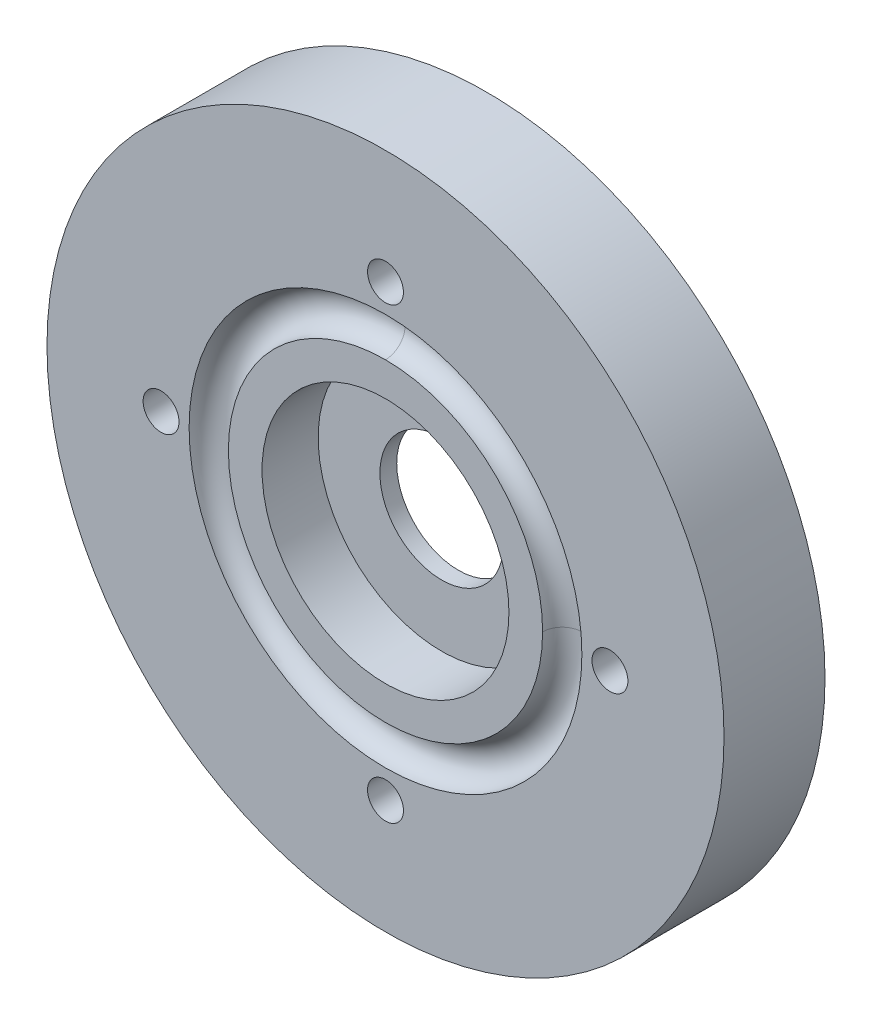
ISO-10303-21;
HEADER;
FILE_DESCRIPTION(('STEP AP214'),'2;1');
FILE_NAME('part.step','',(''),(''),'','','');
FILE_SCHEMA(('AUTOMOTIVE_DESIGN { 1 0 10303 214 1 1 1 1 }'));
ENDSEC;
DATA;
#1=APPLICATION_CONTEXT('core data for automotive mechanical design processes');
#2=APPLICATION_PROTOCOL_DEFINITION('international standard','automotive_design',2000,#1);
#3=PRODUCT_CONTEXT('',#1,'mechanical');
#4=PRODUCT('Part','Part','',(#3));
#5=PRODUCT_RELATED_PRODUCT_CATEGORY('part','',(#4));
#6=PRODUCT_DEFINITION_FORMATION('','',#4);
#7=PRODUCT_DEFINITION_CONTEXT('part definition',#1,'design');
#8=PRODUCT_DEFINITION('design','',#6,#7);
#9=PRODUCT_DEFINITION_SHAPE('','',#8);
#10=(LENGTH_UNIT() NAMED_UNIT(*) SI_UNIT(.MILLI.,.METRE.));
#11=(NAMED_UNIT(*) PLANE_ANGLE_UNIT() SI_UNIT($,.RADIAN.));
#12=(NAMED_UNIT(*) SI_UNIT($,.STERADIAN.) SOLID_ANGLE_UNIT());
#13=UNCERTAINTY_MEASURE_WITH_UNIT(LENGTH_MEASURE(1.E-05),#10,'distance_accuracy_value','');
#14=(GEOMETRIC_REPRESENTATION_CONTEXT(3) GLOBAL_UNCERTAINTY_ASSIGNED_CONTEXT((#13)) GLOBAL_UNIT_ASSIGNED_CONTEXT((#10,
#11,#12)) REPRESENTATION_CONTEXT('',''));
#15=CARTESIAN_POINT('',(0.,0.,0.));
#16=DIRECTION('',(0.,0.,1.));
#17=DIRECTION('',(1.,0.,0.));
#18=AXIS2_PLACEMENT_3D('',#15,#16,#17);
#19=CARTESIAN_POINT('',(0.,0.,4.5));
#20=DIRECTION('',(0.,0.,1.));
#21=DIRECTION('',(1.,0.,0.));
#22=AXIS2_PLACEMENT_3D('',#19,#20,#21);
#23=PLANE('',#22);
#24=CARTESIAN_POINT('',(0.,-20.,4.5));
#25=DIRECTION('',(0.,0.,1.));
#26=DIRECTION('',(1.,0.,0.));
#27=AXIS2_PLACEMENT_3D('',#24,#25,#26);
#28=CIRCLE('',#27,1.6);
#29=CARTESIAN_POINT('',(1.6,-20.,4.5));
#30=VERTEX_POINT('',#29);
#31=EDGE_CURVE('E84',#30,#30,#28,.T.);
#32=ORIENTED_EDGE('',*,*,#31,.F.);
#33=EDGE_LOOP('',(#32));
#34=FACE_BOUND('',#33,.T.);
#35=CARTESIAN_POINT('',(20.,0.,4.5));
#36=DIRECTION('',(0.,0.,1.));
#37=DIRECTION('',(1.,0.,0.));
#38=AXIS2_PLACEMENT_3D('',#35,#36,#37);
#39=CIRCLE('',#38,1.6);
#40=CARTESIAN_POINT('',(21.6,0.,4.5));
#41=VERTEX_POINT('',#40);
#42=EDGE_CURVE('E106',#41,#41,#39,.T.);
#43=ORIENTED_EDGE('',*,*,#42,.F.);
#44=EDGE_LOOP('',(#43));
#45=FACE_BOUND('',#44,.T.);
#46=CARTESIAN_POINT('',(0.,0.,4.5));
#47=DIRECTION('',(0.,0.,1.));
#48=DIRECTION('',(1.,0.,0.));
#49=AXIS2_PLACEMENT_3D('',#46,#47,#48);
#50=CIRCLE('',#49,30.165);
#51=CARTESIAN_POINT('',(30.165,0.,4.5));
#52=VERTEX_POINT('',#51);
#53=EDGE_CURVE('E100',#52,#52,#50,.T.);
#54=ORIENTED_EDGE('',*,*,#53,.T.);
#55=EDGE_LOOP('',(#54));
#56=FACE_BOUND('',#55,.T.);
#57=CARTESIAN_POINT('',(0.,20.,4.5));
#58=DIRECTION('',(0.,0.,1.));
#59=DIRECTION('',(1.,0.,0.));
#60=AXIS2_PLACEMENT_3D('',#57,#58,#59);
#61=CIRCLE('',#60,1.6);
#62=CARTESIAN_POINT('',(1.6,20.,4.5));
#63=VERTEX_POINT('',#62);
#64=EDGE_CURVE('E103',#63,#63,#61,.T.);
#65=ORIENTED_EDGE('',*,*,#64,.F.);
#66=EDGE_LOOP('',(#65));
#67=FACE_BOUND('',#66,.T.);
#68=CARTESIAN_POINT('',(-20.,0.,4.5));
#69=DIRECTION('',(0.,0.,1.));
#70=DIRECTION('',(1.,0.,0.));
#71=AXIS2_PLACEMENT_3D('',#68,#69,#70);
#72=CIRCLE('',#71,1.6);
#73=CARTESIAN_POINT('',(-18.4,0.,4.5));
#74=VERTEX_POINT('',#73);
#75=EDGE_CURVE('E109',#74,#74,#72,.T.);
#76=ORIENTED_EDGE('',*,*,#75,.F.);
#77=EDGE_LOOP('',(#76));
#78=FACE_BOUND('',#77,.T.);
#79=CARTESIAN_POINT('',(0.,0.,4.5));
#80=DIRECTION('',(0.,0.,1.));
#81=DIRECTION('',(1.,0.,0.));
#82=AXIS2_PLACEMENT_3D('',#79,#80,#81);
#83=CIRCLE('',#82,17.5);
#84=CARTESIAN_POINT('',(0.,17.5,4.5));
#85=VERTEX_POINT('',#84);
#86=CARTESIAN_POINT('',(17.5,0.,4.5));
#87=VERTEX_POINT('',#86);
#88=EDGE_CURVE('E11',#85,#87,#83,.T.);
#89=ORIENTED_EDGE('',*,*,#88,.F.);
#90=CARTESIAN_POINT('',(0.,0.,4.5));
#91=DIRECTION('',(0.,0.,1.));
#92=DIRECTION('',(1.,0.,0.));
#93=AXIS2_PLACEMENT_3D('',#90,#91,#92);
#94=CIRCLE('',#93,17.5);
#95=EDGE_CURVE('E43',#87,#85,#94,.T.);
#96=ORIENTED_EDGE('',*,*,#95,.F.);
#97=EDGE_LOOP('',(#89,#96));
#98=FACE_BOUND('',#97,.T.);
#99=ADVANCED_FACE('F35',(#34,#45,#56,#67,#78,#98),#23,.T.);
#100=CARTESIAN_POINT('',(0.,0.,4.5));
#101=DIRECTION('',(0.,0.,1.));
#102=DIRECTION('',(1.,0.,0.));
#103=AXIS2_PLACEMENT_3D('',#100,#101,#102);
#104=CIRCLE('',#103,11.);
#105=CARTESIAN_POINT('',(11.,0.,4.5));
#106=VERTEX_POINT('',#105);
#107=EDGE_CURVE('E71',#106,#106,#104,.T.);
#108=ORIENTED_EDGE('',*,*,#107,.F.);
#109=EDGE_LOOP('',(#108));
#110=FACE_BOUND('',#109,.T.);
#111=CARTESIAN_POINT('',(0.,0.,4.5));
#112=DIRECTION('',(0.,0.,-1.));
#113=DIRECTION('',(-1.,0.,0.));
#114=AXIS2_PLACEMENT_3D('',#111,#112,#113);
#115=CIRCLE('',#114,14.);
#116=CARTESIAN_POINT('',(14.,0.,4.5));
#117=VERTEX_POINT('',#116);
#118=CARTESIAN_POINT('',(0.,14.,4.5));
#119=VERTEX_POINT('',#118);
#120=EDGE_CURVE('E64',#117,#119,#115,.T.);
#121=ORIENTED_EDGE('',*,*,#120,.F.);
#122=CARTESIAN_POINT('',(0.,0.,4.5));
#123=DIRECTION('',(0.,0.,-1.));
#124=DIRECTION('',(-1.,0.,0.));
#125=AXIS2_PLACEMENT_3D('',#122,#123,#124);
#126=CIRCLE('',#125,14.);
#127=EDGE_CURVE('E60',#119,#117,#126,.T.);
#128=ORIENTED_EDGE('',*,*,#127,.F.);
#129=EDGE_LOOP('',(#121,#128));
#130=FACE_BOUND('',#129,.T.);
#131=ADVANCED_FACE('F73',(#110,#130),#23,.T.);
#132=CARTESIAN_POINT('',(0.,0.,-4.5));
#133=DIRECTION('',(0.,0.,1.));
#134=DIRECTION('',(1.,0.,0.));
#135=AXIS2_PLACEMENT_3D('',#132,#133,#134);
#136=CYLINDRICAL_SURFACE('',#135,5.5);
#137=CARTESIAN_POINT('',(0.,0.,-2.));
#138=DIRECTION('',(0.,0.,-1.));
#139=DIRECTION('',(-1.,0.,0.));
#140=AXIS2_PLACEMENT_3D('',#137,#138,#139);
#141=CIRCLE('',#140,5.5);
#142=CARTESIAN_POINT('',(-5.5,0.,-2.));
#143=VERTEX_POINT('',#142);
#144=EDGE_CURVE('E81',#143,#143,#141,.F.);
#145=ORIENTED_EDGE('',*,*,#144,.F.);
#146=EDGE_LOOP('',(#145));
#147=FACE_BOUND('',#146,.T.);
#148=CARTESIAN_POINT('',(0.,0.,-0.5));
#149=DIRECTION('',(0.,0.,1.));
#150=DIRECTION('',(1.,0.,0.));
#151=AXIS2_PLACEMENT_3D('',#148,#149,#150);
#152=CIRCLE('',#151,5.5);
#153=CARTESIAN_POINT('',(5.5,0.,-0.5));
#154=VERTEX_POINT('',#153);
#155=EDGE_CURVE('E76',#154,#154,#152,.F.);
#156=ORIENTED_EDGE('',*,*,#155,.F.);
#157=EDGE_LOOP('',(#156));
#158=FACE_BOUND('',#157,.T.);
#159=ADVANCED_FACE('F129',(#147,#158),#136,.F.);
#160=CARTESIAN_POINT('',(0.,0.,-4.5));
#161=DIRECTION('',(0.,0.,1.));
#162=DIRECTION('',(1.,0.,0.));
#163=AXIS2_PLACEMENT_3D('',#160,#161,#162);
#164=CYLINDRICAL_SURFACE('',#163,30.165);
#165=CARTESIAN_POINT('',(0.,0.,-4.5));
#166=DIRECTION('',(0.,0.,1.));
#167=DIRECTION('',(1.,0.,0.));
#168=AXIS2_PLACEMENT_3D('',#165,#166,#167);
#169=CIRCLE('',#168,30.165);
#170=CARTESIAN_POINT('',(30.165,0.,-4.5));
#171=VERTEX_POINT('',#170);
#172=EDGE_CURVE('E65',#171,#171,#169,.T.);
#173=ORIENTED_EDGE('',*,*,#172,.T.);
#174=EDGE_LOOP('',(#173));
#175=FACE_BOUND('',#174,.T.);
#176=ORIENTED_EDGE('',*,*,#53,.F.);
#177=EDGE_LOOP('',(#176));
#178=FACE_BOUND('',#177,.T.);
#179=ADVANCED_FACE('F37',(#175,#178),#164,.T.);
#180=CARTESIAN_POINT('',(0.,0.,-4.5));
#181=DIRECTION('',(0.,0.,1.));
#182=DIRECTION('',(1.,0.,0.));
#183=AXIS2_PLACEMENT_3D('',#180,#181,#182);
#184=PLANE('',#183);
#185=CARTESIAN_POINT('',(0.,0.,-4.5));
#186=DIRECTION('',(0.,0.,-1.));
#187=DIRECTION('',(-1.,0.,0.));
#188=AXIS2_PLACEMENT_3D('',#185,#186,#187);
#189=CIRCLE('',#188,9.5);
#190=CARTESIAN_POINT('',(-9.5,0.,-4.5));
#191=VERTEX_POINT('',#190);
#192=EDGE_CURVE('E79',#191,#191,#189,.T.);
#193=ORIENTED_EDGE('',*,*,#192,.F.);
#194=EDGE_LOOP('',(#193));
#195=FACE_BOUND('',#194,.T.);
#196=CARTESIAN_POINT('',(0.,-20.,-4.5));
#197=DIRECTION('',(0.,0.,1.));
#198=DIRECTION('',(1.,0.,0.));
#199=AXIS2_PLACEMENT_3D('',#196,#197,#198);
#200=CIRCLE('',#199,1.6);
#201=CARTESIAN_POINT('',(1.6,-20.,-4.5));
#202=VERTEX_POINT('',#201);
#203=EDGE_CURVE('E97',#202,#202,#200,.T.);
#204=ORIENTED_EDGE('',*,*,#203,.T.);
#205=EDGE_LOOP('',(#204));
#206=FACE_BOUND('',#205,.T.);
#207=CARTESIAN_POINT('',(-20.,0.,-4.5));
#208=DIRECTION('',(0.,0.,1.));
#209=DIRECTION('',(1.,0.,0.));
#210=AXIS2_PLACEMENT_3D('',#207,#208,#209);
#211=CIRCLE('',#210,1.6);
#212=CARTESIAN_POINT('',(-18.4,0.,-4.5));
#213=VERTEX_POINT('',#212);
#214=EDGE_CURVE('E94',#213,#213,#211,.T.);
#215=ORIENTED_EDGE('',*,*,#214,.T.);
#216=EDGE_LOOP('',(#215));
#217=FACE_BOUND('',#216,.T.);
#218=CARTESIAN_POINT('',(20.,0.,-4.5));
#219=DIRECTION('',(0.,0.,1.));
#220=DIRECTION('',(1.,0.,0.));
#221=AXIS2_PLACEMENT_3D('',#218,#219,#220);
#222=CIRCLE('',#221,1.6);
#223=CARTESIAN_POINT('',(21.6,0.,-4.5));
#224=VERTEX_POINT('',#223);
#225=EDGE_CURVE('E91',#224,#224,#222,.T.);
#226=ORIENTED_EDGE('',*,*,#225,.T.);
#227=EDGE_LOOP('',(#226));
#228=FACE_BOUND('',#227,.T.);
#229=CARTESIAN_POINT('',(0.,20.,-4.5));
#230=DIRECTION('',(0.,0.,1.));
#231=DIRECTION('',(1.,0.,0.));
#232=AXIS2_PLACEMENT_3D('',#229,#230,#231);
#233=CIRCLE('',#232,1.6);
#234=CARTESIAN_POINT('',(1.6,20.,-4.5));
#235=VERTEX_POINT('',#234);
#236=EDGE_CURVE('E88',#235,#235,#233,.T.);
#237=ORIENTED_EDGE('',*,*,#236,.T.);
#238=EDGE_LOOP('',(#237));
#239=FACE_BOUND('',#238,.T.);
#240=ORIENTED_EDGE('',*,*,#172,.F.);
#241=EDGE_LOOP('',(#240));
#242=FACE_BOUND('',#241,.T.);
#243=ADVANCED_FACE('F153',(#195,#206,#217,#228,#239,#242),#184,.F.);
#244=CARTESIAN_POINT('',(0.,20.,-4.5));
#245=DIRECTION('',(0.,0.,1.));
#246=DIRECTION('',(1.,0.,0.));
#247=AXIS2_PLACEMENT_3D('',#244,#245,#246);
#248=CYLINDRICAL_SURFACE('',#247,1.6);
#249=ORIENTED_EDGE('',*,*,#236,.F.);
#250=EDGE_LOOP('',(#249));
#251=FACE_BOUND('',#250,.T.);
#252=ORIENTED_EDGE('',*,*,#64,.T.);
#253=EDGE_LOOP('',(#252));
#254=FACE_BOUND('',#253,.T.);
#255=ADVANCED_FACE('F149',(#251,#254),#248,.F.);
#256=CARTESIAN_POINT('',(20.,0.,-4.5));
#257=DIRECTION('',(0.,0.,1.));
#258=DIRECTION('',(1.,0.,0.));
#259=AXIS2_PLACEMENT_3D('',#256,#257,#258);
#260=CYLINDRICAL_SURFACE('',#259,1.6);
#261=ORIENTED_EDGE('',*,*,#225,.F.);
#262=EDGE_LOOP('',(#261));
#263=FACE_BOUND('',#262,.T.);
#264=ORIENTED_EDGE('',*,*,#42,.T.);
#265=EDGE_LOOP('',(#264));
#266=FACE_BOUND('',#265,.T.);
#267=ADVANCED_FACE('F145',(#263,#266),#260,.F.);
#268=CARTESIAN_POINT('',(-20.,0.,-4.5));
#269=DIRECTION('',(0.,0.,1.));
#270=DIRECTION('',(1.,0.,0.));
#271=AXIS2_PLACEMENT_3D('',#268,#269,#270);
#272=CYLINDRICAL_SURFACE('',#271,1.6);
#273=ORIENTED_EDGE('',*,*,#214,.F.);
#274=EDGE_LOOP('',(#273));
#275=FACE_BOUND('',#274,.T.);
#276=ORIENTED_EDGE('',*,*,#75,.T.);
#277=EDGE_LOOP('',(#276));
#278=FACE_BOUND('',#277,.T.);
#279=ADVANCED_FACE('F141',(#275,#278),#272,.F.);
#280=CARTESIAN_POINT('',(0.,-20.,-4.5));
#281=DIRECTION('',(0.,0.,1.));
#282=DIRECTION('',(1.,0.,0.));
#283=AXIS2_PLACEMENT_3D('',#280,#281,#282);
#284=CYLINDRICAL_SURFACE('',#283,1.6);
#285=ORIENTED_EDGE('',*,*,#203,.F.);
#286=EDGE_LOOP('',(#285));
#287=FACE_BOUND('',#286,.T.);
#288=ORIENTED_EDGE('',*,*,#31,.T.);
#289=EDGE_LOOP('',(#288));
#290=FACE_BOUND('',#289,.T.);
#291=ADVANCED_FACE('F137',(#287,#290),#284,.F.);
#292=CARTESIAN_POINT('',(0.,0.,-2.));
#293=DIRECTION('',(0.,0.,-1.));
#294=DIRECTION('',(-1.,0.,0.));
#295=AXIS2_PLACEMENT_3D('',#292,#293,#294);
#296=PLANE('',#295);
#297=CARTESIAN_POINT('',(0.,0.,-2.));
#298=DIRECTION('',(0.,0.,-1.));
#299=DIRECTION('',(-1.,0.,0.));
#300=AXIS2_PLACEMENT_3D('',#297,#298,#299);
#301=CIRCLE('',#300,9.5);
#302=CARTESIAN_POINT('',(-9.5,0.,-2.));
#303=VERTEX_POINT('',#302);
#304=EDGE_CURVE('E85',#303,#303,#301,.T.);
#305=ORIENTED_EDGE('',*,*,#304,.T.);
#306=EDGE_LOOP('',(#305));
#307=FACE_BOUND('',#306,.T.);
#308=ORIENTED_EDGE('',*,*,#144,.T.);
#309=EDGE_LOOP('',(#308));
#310=FACE_BOUND('',#309,.T.);
#311=ADVANCED_FACE('F140',(#307,#310),#296,.T.);
#312=CARTESIAN_POINT('',(0.,0.,-2.));
#313=DIRECTION('',(0.,0.,-1.));
#314=DIRECTION('',(-1.,0.,0.));
#315=AXIS2_PLACEMENT_3D('',#312,#313,#314);
#316=CYLINDRICAL_SURFACE('',#315,9.5);
#317=ORIENTED_EDGE('',*,*,#304,.F.);
#318=EDGE_LOOP('',(#317));
#319=FACE_BOUND('',#318,.T.);
#320=ORIENTED_EDGE('',*,*,#192,.T.);
#321=EDGE_LOOP('',(#320));
#322=FACE_BOUND('',#321,.T.);
#323=ADVANCED_FACE('F135',(#319,#322),#316,.F.);
#324=CARTESIAN_POINT('',(0.,0.,-0.5));
#325=DIRECTION('',(0.,0.,1.));
#326=DIRECTION('',(1.,0.,0.));
#327=AXIS2_PLACEMENT_3D('',#324,#325,#326);
#328=PLANE('',#327);
#329=CARTESIAN_POINT('',(0.,0.,-0.5));
#330=DIRECTION('',(0.,0.,1.));
#331=DIRECTION('',(1.,0.,0.));
#332=AXIS2_PLACEMENT_3D('',#329,#330,#331);
#333=CIRCLE('',#332,11.);
#334=CARTESIAN_POINT('',(11.,0.,-0.5));
#335=VERTEX_POINT('',#334);
#336=EDGE_CURVE('E80',#335,#335,#333,.T.);
#337=ORIENTED_EDGE('',*,*,#336,.T.);
#338=EDGE_LOOP('',(#337));
#339=FACE_BOUND('',#338,.T.);
#340=ORIENTED_EDGE('',*,*,#155,.T.);
#341=EDGE_LOOP('',(#340));
#342=FACE_BOUND('',#341,.T.);
#343=ADVANCED_FACE('F188',(#339,#342),#328,.T.);
#344=CARTESIAN_POINT('',(0.,0.,-0.5));
#345=DIRECTION('',(0.,0.,1.));
#346=DIRECTION('',(1.,0.,0.));
#347=AXIS2_PLACEMENT_3D('',#344,#345,#346);
#348=CYLINDRICAL_SURFACE('',#347,11.);
#349=ORIENTED_EDGE('',*,*,#336,.F.);
#350=EDGE_LOOP('',(#349));
#351=FACE_BOUND('',#350,.T.);
#352=ORIENTED_EDGE('',*,*,#107,.T.);
#353=EDGE_LOOP('',(#352));
#354=FACE_BOUND('',#353,.T.);
#355=ADVANCED_FACE('F194',(#351,#354),#348,.F.);
#356=CARTESIAN_POINT('',(0.,0.,4.5));
#357=DIRECTION('',(0.,0.,-1.));
#358=DIRECTION('',(-1.,0.,0.));
#359=AXIS2_PLACEMENT_3D('',#356,#357,#358);
#360=TOROIDAL_SURFACE('',#359,15.75,1.75);
#361=ORIENTED_EDGE('',*,*,#88,.T.);
#362=CARTESIAN_POINT('',(15.75,0.,4.5));
#363=DIRECTION('',(0.,-1.,0.));
#364=DIRECTION('',(0.,0.,-1.));
#365=AXIS2_PLACEMENT_3D('',#362,#363,#364);
#366=CIRCLE('',#365,1.75);
#367=EDGE_CURVE('E50',#117,#87,#366,.T.);
#368=ORIENTED_EDGE('',*,*,#367,.F.);
#369=ORIENTED_EDGE('',*,*,#120,.T.);
#370=CARTESIAN_POINT('',(0.,15.75,4.5));
#371=DIRECTION('',(1.,0.,0.));
#372=DIRECTION('',(0.,0.,-1.));
#373=AXIS2_PLACEMENT_3D('',#370,#371,#372);
#374=CIRCLE('',#373,1.75);
#375=EDGE_CURVE('E54',#119,#85,#374,.T.);
#376=ORIENTED_EDGE('',*,*,#375,.T.);
#377=EDGE_LOOP('',(#361,#368,#369,#376));
#378=FACE_BOUND('',#377,.T.);
#379=ADVANCED_FACE('F68',(#378),#360,.F.);
#380=CARTESIAN_POINT('',(0.,0.,4.5));
#381=DIRECTION('',(0.,0.,-1.));
#382=DIRECTION('',(-1.,0.,0.));
#383=AXIS2_PLACEMENT_3D('',#380,#381,#382);
#384=TOROIDAL_SURFACE('',#383,15.75,1.75);
#385=ORIENTED_EDGE('',*,*,#95,.T.);
#386=ORIENTED_EDGE('',*,*,#375,.F.);
#387=ORIENTED_EDGE('',*,*,#127,.T.);
#388=ORIENTED_EDGE('',*,*,#367,.T.);
#389=EDGE_LOOP('',(#385,#386,#387,#388));
#390=FACE_BOUND('',#389,.T.);
#391=ADVANCED_FACE('F61',(#390),#384,.F.);
#392=CLOSED_SHELL('',(#99,#131,#159,#179,#243,#255,#267,#279,#291,#311,#323,#343,#355,#379,#391));
#393=MANIFOLD_SOLID_BREP('B2',#392);
#394=ADVANCED_BREP_SHAPE_REPRESENTATION('',(#18,#393),#14);
#395=SHAPE_DEFINITION_REPRESENTATION(#9,#394);
ENDSEC;
END-ISO-10303-21;
